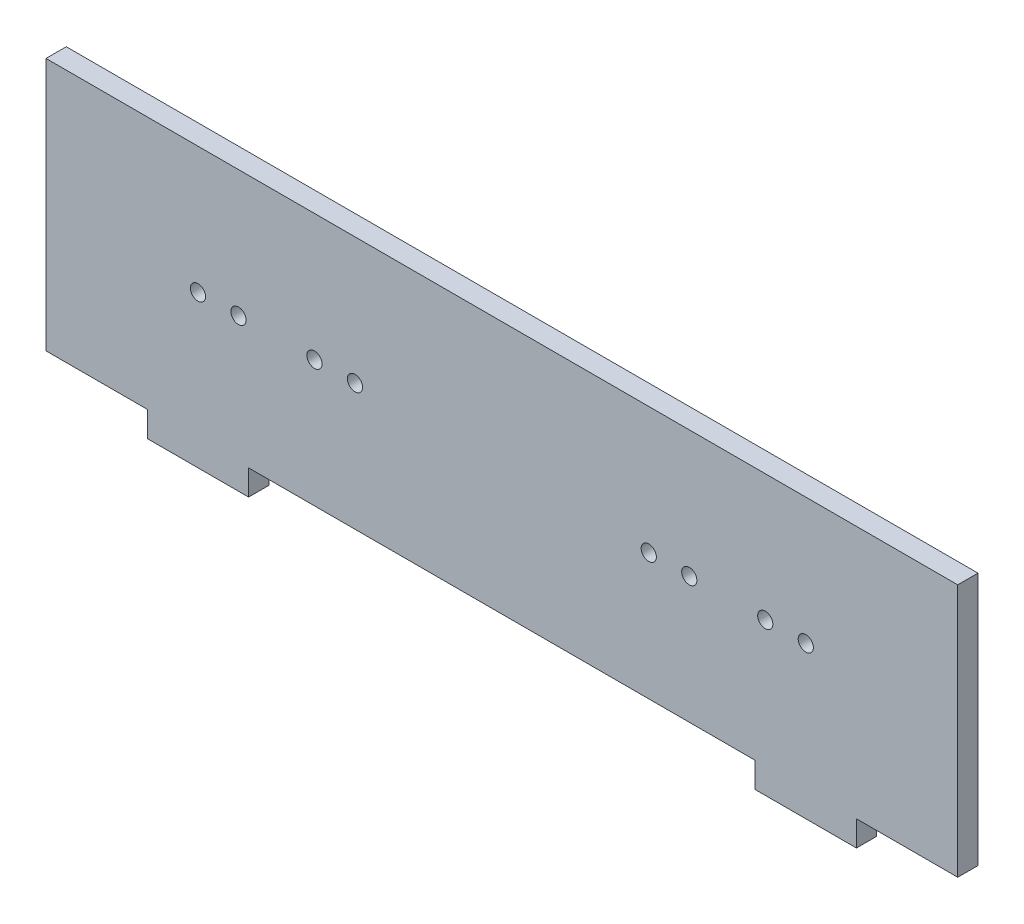
ISO-10303-21;
HEADER;
FILE_DESCRIPTION(('STEP AP214'),'2;1');
FILE_NAME('part.step','',(''),(''),'','','');
FILE_SCHEMA(('AUTOMOTIVE_DESIGN { 1 0 10303 214 1 1 1 1 }'));
ENDSEC;
DATA;
#1=APPLICATION_CONTEXT('core data for automotive mechanical design processes');
#2=APPLICATION_PROTOCOL_DEFINITION('international standard','automotive_design',2000,#1);
#3=PRODUCT_CONTEXT('',#1,'mechanical');
#4=PRODUCT('Part','Part','',(#3));
#5=PRODUCT_RELATED_PRODUCT_CATEGORY('part','',(#4));
#6=PRODUCT_DEFINITION_FORMATION('','',#4);
#7=PRODUCT_DEFINITION_CONTEXT('part definition',#1,'design');
#8=PRODUCT_DEFINITION('design','',#6,#7);
#9=PRODUCT_DEFINITION_SHAPE('','',#8);
#10=(LENGTH_UNIT() NAMED_UNIT(*) SI_UNIT(.MILLI.,.METRE.));
#11=(NAMED_UNIT(*) PLANE_ANGLE_UNIT() SI_UNIT($,.RADIAN.));
#12=(NAMED_UNIT(*) SI_UNIT($,.STERADIAN.) SOLID_ANGLE_UNIT());
#13=UNCERTAINTY_MEASURE_WITH_UNIT(LENGTH_MEASURE(1.E-05),#10,'distance_accuracy_value','');
#14=(GEOMETRIC_REPRESENTATION_CONTEXT(3) GLOBAL_UNCERTAINTY_ASSIGNED_CONTEXT((#13)) GLOBAL_UNIT_ASSIGNED_CONTEXT((#10,
#11,#12)) REPRESENTATION_CONTEXT('',''));
#15=CARTESIAN_POINT('',(0.,0.,0.));
#16=DIRECTION('',(0.,0.,1.));
#17=DIRECTION('',(1.,0.,0.));
#18=AXIS2_PLACEMENT_3D('',#15,#16,#17);
#19=CARTESIAN_POINT('',(0.,0.,4.));
#20=DIRECTION('',(0.,0.,1.));
#21=DIRECTION('',(1.,0.,0.));
#22=AXIS2_PLACEMENT_3D('',#19,#20,#21);
#23=PLANE('',#22);
#24=CARTESIAN_POINT('',(39.7006420545747,-6.11712598425197,4.));
#25=DIRECTION('',(0.,0.,1.));
#26=DIRECTION('',(1.,0.,0.));
#27=AXIS2_PLACEMENT_3D('',#24,#25,#26);
#28=CIRCLE('',#27,1.5);
#29=CARTESIAN_POINT('',(41.2006420545747,-6.11712598425197,4.));
#30=VERTEX_POINT('',#29);
#31=EDGE_CURVE('E306',#30,#30,#28,.T.);
#32=ORIENTED_EDGE('',*,*,#31,.F.);
#33=EDGE_LOOP('',(#32));
#34=FACE_BOUND('',#33,.T.);
#35=CARTESIAN_POINT('',(-34.2993579454253,-6.11712598425197,4.));
#36=DIRECTION('',(0.,0.,1.));
#37=DIRECTION('',(1.,0.,0.));
#38=AXIS2_PLACEMENT_3D('',#35,#36,#37);
#39=CIRCLE('',#38,1.5);
#40=CARTESIAN_POINT('',(-32.7993579454253,-6.11712598425197,4.));
#41=VERTEX_POINT('',#40);
#42=EDGE_CURVE('E318',#41,#41,#39,.T.);
#43=ORIENTED_EDGE('',*,*,#42,.F.);
#44=EDGE_LOOP('',(#43));
#45=FACE_BOUND('',#44,.T.);
#46=CARTESIAN_POINT('',(-49.2993579454253,-6.11712598425197,4.));
#47=DIRECTION('',(0.,0.,1.));
#48=DIRECTION('',(1.,0.,0.));
#49=AXIS2_PLACEMENT_3D('',#46,#47,#48);
#50=CIRCLE('',#49,1.5);
#51=CARTESIAN_POINT('',(-47.7993579454253,-6.11712598425197,4.));
#52=VERTEX_POINT('',#51);
#53=EDGE_CURVE('E330',#52,#52,#50,.T.);
#54=ORIENTED_EDGE('',*,*,#53,.F.);
#55=EDGE_LOOP('',(#54));
#56=FACE_BOUND('',#55,.T.);
#57=CARTESIAN_POINT('',(-57.2993579454253,-6.11712598425197,4.));
#58=DIRECTION('',(0.,0.,1.));
#59=DIRECTION('',(1.,0.,0.));
#60=AXIS2_PLACEMENT_3D('',#57,#58,#59);
#61=CIRCLE('',#60,1.5);
#62=CARTESIAN_POINT('',(-55.7993579454253,-6.11712598425197,4.));
#63=VERTEX_POINT('',#62);
#64=EDGE_CURVE('E157',#63,#63,#61,.T.);
#65=ORIENTED_EDGE('',*,*,#64,.F.);
#66=EDGE_LOOP('',(#65));
#67=FACE_BOUND('',#66,.T.);
#68=DIRECTION('',(0.,-1.,0.));
#69=VECTOR('',#68,1.);
#70=CARTESIAN_POINT('',(-87.2993579454253,18.882874015748,4.));
#71=LINE('',#70,#69);
#72=CARTESIAN_POINT('',(-87.2993579454253,18.882874015748,4.));
#73=VERTEX_POINT('',#72);
#74=CARTESIAN_POINT('',(-87.2993579454253,-31.117125984252,4.));
#75=VERTEX_POINT('',#74);
#76=EDGE_CURVE('E176',#73,#75,#71,.T.);
#77=ORIENTED_EDGE('',*,*,#76,.T.);
#78=DIRECTION('',(1.,0.,0.));
#79=VECTOR('',#78,1.);
#80=CARTESIAN_POINT('',(-87.2993579454253,-31.117125984252,4.));
#81=LINE('',#80,#79);
#82=CARTESIAN_POINT('',(-67.2993579454253,-31.117125984252,4.));
#83=VERTEX_POINT('',#82);
#84=EDGE_CURVE('E104',#75,#83,#81,.T.);
#85=ORIENTED_EDGE('',*,*,#84,.T.);
#86=DIRECTION('',(0.,-1.,0.));
#87=VECTOR('',#86,1.);
#88=CARTESIAN_POINT('',(-67.2993579454253,-31.117125984252,4.));
#89=LINE('',#88,#87);
#90=CARTESIAN_POINT('',(-67.2993579454253,-36.117125984252,4.));
#91=VERTEX_POINT('',#90);
#92=EDGE_CURVE('E203',#83,#91,#89,.T.);
#93=ORIENTED_EDGE('',*,*,#92,.T.);
#94=DIRECTION('',(1.,0.,0.));
#95=VECTOR('',#94,1.);
#96=CARTESIAN_POINT('',(-67.2993579454253,-36.117125984252,4.));
#97=LINE('',#96,#95);
#98=CARTESIAN_POINT('',(-47.2993579454253,-36.117125984252,4.));
#99=VERTEX_POINT('',#98);
#100=EDGE_CURVE('E222',#91,#99,#97,.T.);
#101=ORIENTED_EDGE('',*,*,#100,.T.);
#102=DIRECTION('',(0.,1.,0.));
#103=VECTOR('',#102,1.);
#104=CARTESIAN_POINT('',(-47.2993579454253,-31.117125984252,4.));
#105=LINE('',#104,#103);
#106=CARTESIAN_POINT('',(-47.2993579454253,-31.117125984252,4.));
#107=VERTEX_POINT('',#106);
#108=EDGE_CURVE('E219',#99,#107,#105,.T.);
#109=ORIENTED_EDGE('',*,*,#108,.T.);
#110=DIRECTION('',(1.,0.,0.));
#111=VECTOR('',#110,1.);
#112=CARTESIAN_POINT('',(-47.2993579454253,-31.117125984252,4.));
#113=LINE('',#112,#111);
#114=CARTESIAN_POINT('',(52.7006420545747,-31.117125984252,4.));
#115=VERTEX_POINT('',#114);
#116=EDGE_CURVE('E221',#107,#115,#113,.T.);
#117=ORIENTED_EDGE('',*,*,#116,.T.);
#118=DIRECTION('',(0.,-1.,0.));
#119=VECTOR('',#118,1.);
#120=CARTESIAN_POINT('',(52.7006420545747,-31.117125984252,4.));
#121=LINE('',#120,#119);
#122=CARTESIAN_POINT('',(52.7006420545747,-36.117125984252,4.));
#123=VERTEX_POINT('',#122);
#124=EDGE_CURVE('E224',#115,#123,#121,.T.);
#125=ORIENTED_EDGE('',*,*,#124,.T.);
#126=DIRECTION('',(1.,0.,0.));
#127=VECTOR('',#126,1.);
#128=CARTESIAN_POINT('',(52.7006420545747,-36.117125984252,4.));
#129=LINE('',#128,#127);
#130=CARTESIAN_POINT('',(72.7006420545747,-36.117125984252,4.));
#131=VERTEX_POINT('',#130);
#132=EDGE_CURVE('E230',#123,#131,#129,.T.);
#133=ORIENTED_EDGE('',*,*,#132,.T.);
#134=DIRECTION('',(0.,1.,0.));
#135=VECTOR('',#134,1.);
#136=CARTESIAN_POINT('',(72.7006420545747,-31.117125984252,4.));
#137=LINE('',#136,#135);
#138=CARTESIAN_POINT('',(72.7006420545747,-31.117125984252,4.));
#139=VERTEX_POINT('',#138);
#140=EDGE_CURVE('E135',#131,#139,#137,.T.);
#141=ORIENTED_EDGE('',*,*,#140,.T.);
#142=DIRECTION('',(1.,0.,0.));
#143=VECTOR('',#142,1.);
#144=CARTESIAN_POINT('',(72.7006420545747,-31.117125984252,4.));
#145=LINE('',#144,#143);
#146=CARTESIAN_POINT('',(92.7006420545746,-31.117125984252,4.));
#147=VERTEX_POINT('',#146);
#148=EDGE_CURVE('E129',#139,#147,#145,.T.);
#149=ORIENTED_EDGE('',*,*,#148,.T.);
#150=DIRECTION('',(0.,1.,0.));
#151=VECTOR('',#150,1.);
#152=CARTESIAN_POINT('',(92.7006420545746,18.882874015748,4.));
#153=LINE('',#152,#151);
#154=CARTESIAN_POINT('',(92.7006420545746,18.882874015748,4.));
#155=VERTEX_POINT('',#154);
#156=EDGE_CURVE('E133',#147,#155,#153,.T.);
#157=ORIENTED_EDGE('',*,*,#156,.T.);
#158=DIRECTION('',(-1.,0.,0.));
#159=VECTOR('',#158,1.);
#160=CARTESIAN_POINT('',(-87.2993579454253,18.882874015748,4.));
#161=LINE('',#160,#159);
#162=EDGE_CURVE('E49',#155,#73,#161,.T.);
#163=ORIENTED_EDGE('',*,*,#162,.T.);
#164=EDGE_LOOP('',(#77,#85,#93,#101,#109,#117,#125,#133,#141,#149,#157,#163));
#165=FACE_BOUND('',#164,.T.);
#166=CARTESIAN_POINT('',(62.7006420545747,-6.11712598425197,4.));
#167=DIRECTION('',(0.,0.,1.));
#168=DIRECTION('',(1.,0.,0.));
#169=AXIS2_PLACEMENT_3D('',#166,#167,#168);
#170=CIRCLE('',#169,1.49999999999998);
#171=CARTESIAN_POINT('',(64.2006420545746,-6.11712598425197,4.));
#172=VERTEX_POINT('',#171);
#173=EDGE_CURVE('E336',#172,#172,#170,.T.);
#174=ORIENTED_EDGE('',*,*,#173,.F.);
#175=EDGE_LOOP('',(#174));
#176=FACE_BOUND('',#175,.T.);
#177=CARTESIAN_POINT('',(54.7006420545747,-6.11712598425197,4.));
#178=DIRECTION('',(0.,0.,1.));
#179=DIRECTION('',(1.,0.,0.));
#180=AXIS2_PLACEMENT_3D('',#177,#178,#179);
#181=CIRCLE('',#180,1.5);
#182=CARTESIAN_POINT('',(56.2006420545746,-6.11712598425197,4.));
#183=VERTEX_POINT('',#182);
#184=EDGE_CURVE('E324',#183,#183,#181,.T.);
#185=ORIENTED_EDGE('',*,*,#184,.F.);
#186=EDGE_LOOP('',(#185));
#187=FACE_BOUND('',#186,.T.);
#188=CARTESIAN_POINT('',(-26.2993579454253,-6.11712598425197,4.));
#189=DIRECTION('',(0.,0.,1.));
#190=DIRECTION('',(1.,0.,0.));
#191=AXIS2_PLACEMENT_3D('',#188,#189,#190);
#192=CIRCLE('',#191,1.5);
#193=CARTESIAN_POINT('',(-24.7993579454253,-6.11712598425197,4.));
#194=VERTEX_POINT('',#193);
#195=EDGE_CURVE('E312',#194,#194,#192,.T.);
#196=ORIENTED_EDGE('',*,*,#195,.F.);
#197=EDGE_LOOP('',(#196));
#198=FACE_BOUND('',#197,.T.);
#199=CARTESIAN_POINT('',(31.7006420545747,-6.11712598425197,4.));
#200=DIRECTION('',(0.,0.,1.));
#201=DIRECTION('',(1.,0.,0.));
#202=AXIS2_PLACEMENT_3D('',#199,#200,#201);
#203=CIRCLE('',#202,1.5);
#204=CARTESIAN_POINT('',(33.2006420545747,-6.11712598425197,4.));
#205=VERTEX_POINT('',#204);
#206=EDGE_CURVE('E297',#205,#205,#203,.T.);
#207=ORIENTED_EDGE('',*,*,#206,.F.);
#208=EDGE_LOOP('',(#207));
#209=FACE_BOUND('',#208,.T.);
#210=ADVANCED_FACE('F32',(#34,#45,#56,#67,#165,#176,#187,#198,#209),#23,.T.);
#211=CARTESIAN_POINT('',(0.,0.,0.));
#212=DIRECTION('',(0.,0.,1.));
#213=DIRECTION('',(1.,0.,0.));
#214=AXIS2_PLACEMENT_3D('',#211,#212,#213);
#215=PLANE('',#214);
#216=DIRECTION('',(0.,-1.,0.));
#217=VECTOR('',#216,1.);
#218=CARTESIAN_POINT('',(-87.2993579454253,18.882874015748,0.));
#219=LINE('',#218,#217);
#220=CARTESIAN_POINT('',(-87.2993579454253,18.882874015748,0.));
#221=VERTEX_POINT('',#220);
#222=CARTESIAN_POINT('',(-87.2993579454253,-31.117125984252,0.));
#223=VERTEX_POINT('',#222);
#224=EDGE_CURVE('E153',#221,#223,#219,.T.);
#225=ORIENTED_EDGE('',*,*,#224,.F.);
#226=DIRECTION('',(-1.,0.,0.));
#227=VECTOR('',#226,1.);
#228=CARTESIAN_POINT('',(-87.2993579454253,18.882874015748,0.));
#229=LINE('',#228,#227);
#230=CARTESIAN_POINT('',(92.7006420545746,18.882874015748,0.));
#231=VERTEX_POINT('',#230);
#232=EDGE_CURVE('E96',#231,#221,#229,.T.);
#233=ORIENTED_EDGE('',*,*,#232,.F.);
#234=DIRECTION('',(0.,1.,0.));
#235=VECTOR('',#234,1.);
#236=CARTESIAN_POINT('',(92.7006420545746,18.882874015748,0.));
#237=LINE('',#236,#235);
#238=CARTESIAN_POINT('',(92.7006420545746,-31.117125984252,0.));
#239=VERTEX_POINT('',#238);
#240=EDGE_CURVE('E90',#239,#231,#237,.T.);
#241=ORIENTED_EDGE('',*,*,#240,.F.);
#242=DIRECTION('',(1.,0.,0.));
#243=VECTOR('',#242,1.);
#244=CARTESIAN_POINT('',(72.7006420545747,-31.117125984252,0.));
#245=LINE('',#244,#243);
#246=CARTESIAN_POINT('',(72.7006420545747,-31.117125984252,0.));
#247=VERTEX_POINT('',#246);
#248=EDGE_CURVE('E143',#247,#239,#245,.T.);
#249=ORIENTED_EDGE('',*,*,#248,.F.);
#250=DIRECTION('',(0.,1.,0.));
#251=VECTOR('',#250,1.);
#252=CARTESIAN_POINT('',(72.7006420545747,-31.117125984252,0.));
#253=LINE('',#252,#251);
#254=CARTESIAN_POINT('',(72.7006420545747,-36.117125984252,0.));
#255=VERTEX_POINT('',#254);
#256=EDGE_CURVE('E171',#255,#247,#253,.T.);
#257=ORIENTED_EDGE('',*,*,#256,.F.);
#258=DIRECTION('',(1.,0.,0.));
#259=VECTOR('',#258,1.);
#260=CARTESIAN_POINT('',(52.7006420545747,-36.117125984252,0.));
#261=LINE('',#260,#259);
#262=CARTESIAN_POINT('',(52.7006420545747,-36.117125984252,0.));
#263=VERTEX_POINT('',#262);
#264=EDGE_CURVE('E169',#263,#255,#261,.T.);
#265=ORIENTED_EDGE('',*,*,#264,.F.);
#266=DIRECTION('',(0.,-1.,0.));
#267=VECTOR('',#266,1.);
#268=CARTESIAN_POINT('',(52.7006420545747,-31.117125984252,0.));
#269=LINE('',#268,#267);
#270=CARTESIAN_POINT('',(52.7006420545747,-31.117125984252,0.));
#271=VERTEX_POINT('',#270);
#272=EDGE_CURVE('E167',#271,#263,#269,.T.);
#273=ORIENTED_EDGE('',*,*,#272,.F.);
#274=DIRECTION('',(1.,0.,0.));
#275=VECTOR('',#274,1.);
#276=CARTESIAN_POINT('',(-47.2993579454253,-31.117125984252,0.));
#277=LINE('',#276,#275);
#278=CARTESIAN_POINT('',(-47.2993579454253,-31.117125984252,0.));
#279=VERTEX_POINT('',#278);
#280=EDGE_CURVE('E165',#279,#271,#277,.T.);
#281=ORIENTED_EDGE('',*,*,#280,.F.);
#282=DIRECTION('',(0.,1.,0.));
#283=VECTOR('',#282,1.);
#284=CARTESIAN_POINT('',(-47.2993579454253,-31.117125984252,0.));
#285=LINE('',#284,#283);
#286=CARTESIAN_POINT('',(-47.2993579454253,-36.117125984252,0.));
#287=VERTEX_POINT('',#286);
#288=EDGE_CURVE('E163',#287,#279,#285,.T.);
#289=ORIENTED_EDGE('',*,*,#288,.F.);
#290=DIRECTION('',(1.,0.,0.));
#291=VECTOR('',#290,1.);
#292=CARTESIAN_POINT('',(-67.2993579454253,-36.117125984252,0.));
#293=LINE('',#292,#291);
#294=CARTESIAN_POINT('',(-67.2993579454253,-36.117125984252,0.));
#295=VERTEX_POINT('',#294);
#296=EDGE_CURVE('E161',#295,#287,#293,.T.);
#297=ORIENTED_EDGE('',*,*,#296,.F.);
#298=DIRECTION('',(0.,-1.,0.));
#299=VECTOR('',#298,1.);
#300=CARTESIAN_POINT('',(-67.2993579454253,-31.117125984252,0.));
#301=LINE('',#300,#299);
#302=CARTESIAN_POINT('',(-67.2993579454253,-31.117125984252,0.));
#303=VERTEX_POINT('',#302);
#304=EDGE_CURVE('E159',#303,#295,#301,.T.);
#305=ORIENTED_EDGE('',*,*,#304,.F.);
#306=DIRECTION('',(1.,0.,0.));
#307=VECTOR('',#306,1.);
#308=CARTESIAN_POINT('',(-87.2993579454253,-31.117125984252,0.));
#309=LINE('',#308,#307);
#310=EDGE_CURVE('E156',#223,#303,#309,.T.);
#311=ORIENTED_EDGE('',*,*,#310,.F.);
#312=EDGE_LOOP('',(#225,#233,#241,#249,#257,#265,#273,#281,#289,#297,#305,#311));
#313=FACE_BOUND('',#312,.T.);
#314=CARTESIAN_POINT('',(-57.2993579454253,-6.11712598425197,0.));
#315=DIRECTION('',(0.,0.,1.));
#316=DIRECTION('',(1.,0.,0.));
#317=AXIS2_PLACEMENT_3D('',#314,#315,#316);
#318=CIRCLE('',#317,1.5);
#319=CARTESIAN_POINT('',(-55.7993579454253,-6.11712598425197,0.));
#320=VERTEX_POINT('',#319);
#321=EDGE_CURVE('E339',#320,#320,#318,.T.);
#322=ORIENTED_EDGE('',*,*,#321,.T.);
#323=EDGE_LOOP('',(#322));
#324=FACE_BOUND('',#323,.T.);
#325=CARTESIAN_POINT('',(62.7006420545747,-6.11712598425197,0.));
#326=DIRECTION('',(0.,0.,1.));
#327=DIRECTION('',(1.,0.,0.));
#328=AXIS2_PLACEMENT_3D('',#325,#326,#327);
#329=CIRCLE('',#328,1.49999999999998);
#330=CARTESIAN_POINT('',(64.2006420545746,-6.11712598425197,0.));
#331=VERTEX_POINT('',#330);
#332=EDGE_CURVE('E333',#331,#331,#329,.T.);
#333=ORIENTED_EDGE('',*,*,#332,.T.);
#334=EDGE_LOOP('',(#333));
#335=FACE_BOUND('',#334,.T.);
#336=CARTESIAN_POINT('',(-49.2993579454253,-6.11712598425197,0.));
#337=DIRECTION('',(0.,0.,1.));
#338=DIRECTION('',(1.,0.,0.));
#339=AXIS2_PLACEMENT_3D('',#336,#337,#338);
#340=CIRCLE('',#339,1.5);
#341=CARTESIAN_POINT('',(-47.7993579454253,-6.11712598425197,0.));
#342=VERTEX_POINT('',#341);
#343=EDGE_CURVE('E327',#342,#342,#340,.T.);
#344=ORIENTED_EDGE('',*,*,#343,.T.);
#345=EDGE_LOOP('',(#344));
#346=FACE_BOUND('',#345,.T.);
#347=CARTESIAN_POINT('',(54.7006420545747,-6.11712598425197,0.));
#348=DIRECTION('',(0.,0.,1.));
#349=DIRECTION('',(1.,0.,0.));
#350=AXIS2_PLACEMENT_3D('',#347,#348,#349);
#351=CIRCLE('',#350,1.5);
#352=CARTESIAN_POINT('',(56.2006420545746,-6.11712598425197,0.));
#353=VERTEX_POINT('',#352);
#354=EDGE_CURVE('E321',#353,#353,#351,.T.);
#355=ORIENTED_EDGE('',*,*,#354,.T.);
#356=EDGE_LOOP('',(#355));
#357=FACE_BOUND('',#356,.T.);
#358=CARTESIAN_POINT('',(-34.2993579454253,-6.11712598425197,0.));
#359=DIRECTION('',(0.,0.,1.));
#360=DIRECTION('',(1.,0.,0.));
#361=AXIS2_PLACEMENT_3D('',#358,#359,#360);
#362=CIRCLE('',#361,1.5);
#363=CARTESIAN_POINT('',(-32.7993579454253,-6.11712598425197,0.));
#364=VERTEX_POINT('',#363);
#365=EDGE_CURVE('E315',#364,#364,#362,.T.);
#366=ORIENTED_EDGE('',*,*,#365,.T.);
#367=EDGE_LOOP('',(#366));
#368=FACE_BOUND('',#367,.T.);
#369=CARTESIAN_POINT('',(-26.2993579454253,-6.11712598425197,0.));
#370=DIRECTION('',(0.,0.,1.));
#371=DIRECTION('',(1.,0.,0.));
#372=AXIS2_PLACEMENT_3D('',#369,#370,#371);
#373=CIRCLE('',#372,1.5);
#374=CARTESIAN_POINT('',(-24.7993579454253,-6.11712598425197,0.));
#375=VERTEX_POINT('',#374);
#376=EDGE_CURVE('E309',#375,#375,#373,.T.);
#377=ORIENTED_EDGE('',*,*,#376,.T.);
#378=EDGE_LOOP('',(#377));
#379=FACE_BOUND('',#378,.T.);
#380=CARTESIAN_POINT('',(39.7006420545747,-6.11712598425197,0.));
#381=DIRECTION('',(0.,0.,1.));
#382=DIRECTION('',(1.,0.,0.));
#383=AXIS2_PLACEMENT_3D('',#380,#381,#382);
#384=CIRCLE('',#383,1.5);
#385=CARTESIAN_POINT('',(41.2006420545747,-6.11712598425197,0.));
#386=VERTEX_POINT('',#385);
#387=EDGE_CURVE('E303',#386,#386,#384,.T.);
#388=ORIENTED_EDGE('',*,*,#387,.T.);
#389=EDGE_LOOP('',(#388));
#390=FACE_BOUND('',#389,.T.);
#391=CARTESIAN_POINT('',(31.7006420545747,-6.11712598425197,0.));
#392=DIRECTION('',(0.,0.,1.));
#393=DIRECTION('',(1.,0.,0.));
#394=AXIS2_PLACEMENT_3D('',#391,#392,#393);
#395=CIRCLE('',#394,1.5);
#396=CARTESIAN_POINT('',(33.2006420545747,-6.11712598425197,0.));
#397=VERTEX_POINT('',#396);
#398=EDGE_CURVE('E300',#397,#397,#395,.T.);
#399=ORIENTED_EDGE('',*,*,#398,.T.);
#400=EDGE_LOOP('',(#399));
#401=FACE_BOUND('',#400,.T.);
#402=ADVANCED_FACE('F207',(#313,#324,#335,#346,#357,#368,#379,#390,#401),#215,.F.);
#403=CARTESIAN_POINT('',(-87.2993579454253,18.882874015748,4.));
#404=DIRECTION('',(1.,0.,0.));
#405=DIRECTION('',(0.,1.,0.));
#406=AXIS2_PLACEMENT_3D('',#403,#404,#405);
#407=PLANE('',#406);
#408=ORIENTED_EDGE('',*,*,#224,.T.);
#409=DIRECTION('',(0.,0.,-1.));
#410=VECTOR('',#409,1.);
#411=CARTESIAN_POINT('',(-87.2993579454253,-31.117125984252,4.));
#412=LINE('',#411,#410);
#413=EDGE_CURVE('E11',#75,#223,#412,.T.);
#414=ORIENTED_EDGE('',*,*,#413,.F.);
#415=ORIENTED_EDGE('',*,*,#76,.F.);
#416=DIRECTION('',(0.,0.,-1.));
#417=VECTOR('',#416,1.);
#418=CARTESIAN_POINT('',(-87.2993579454253,18.882874015748,4.));
#419=LINE('',#418,#417);
#420=EDGE_CURVE('E149',#73,#221,#419,.T.);
#421=ORIENTED_EDGE('',*,*,#420,.T.);
#422=EDGE_LOOP('',(#408,#414,#415,#421));
#423=FACE_BOUND('',#422,.T.);
#424=ADVANCED_FACE('F34',(#423),#407,.F.);
#425=CARTESIAN_POINT('',(-87.2993579454253,-31.117125984252,4.));
#426=DIRECTION('',(0.,1.,0.));
#427=DIRECTION('',(0.,0.,1.));
#428=AXIS2_PLACEMENT_3D('',#425,#426,#427);
#429=PLANE('',#428);
#430=ORIENTED_EDGE('',*,*,#310,.T.);
#431=DIRECTION('',(0.,0.,-1.));
#432=VECTOR('',#431,1.);
#433=CARTESIAN_POINT('',(-67.2993579454253,-31.117125984252,4.));
#434=LINE('',#433,#432);
#435=EDGE_CURVE('E41',#83,#303,#434,.T.);
#436=ORIENTED_EDGE('',*,*,#435,.F.);
#437=ORIENTED_EDGE('',*,*,#84,.F.);
#438=ORIENTED_EDGE('',*,*,#413,.T.);
#439=EDGE_LOOP('',(#430,#436,#437,#438));
#440=FACE_BOUND('',#439,.T.);
#441=ADVANCED_FACE('F485',(#440),#429,.F.);
#442=CARTESIAN_POINT('',(-67.2993579454253,-31.117125984252,4.));
#443=DIRECTION('',(1.,0.,0.));
#444=DIRECTION('',(0.,0.,-1.));
#445=AXIS2_PLACEMENT_3D('',#442,#443,#444);
#446=PLANE('',#445);
#447=ORIENTED_EDGE('',*,*,#304,.T.);
#448=DIRECTION('',(0.,0.,-1.));
#449=VECTOR('',#448,1.);
#450=CARTESIAN_POINT('',(-67.2993579454253,-36.117125984252,4.));
#451=LINE('',#450,#449);
#452=EDGE_CURVE('E195',#91,#295,#451,.T.);
#453=ORIENTED_EDGE('',*,*,#452,.F.);
#454=ORIENTED_EDGE('',*,*,#92,.F.);
#455=ORIENTED_EDGE('',*,*,#435,.T.);
#456=EDGE_LOOP('',(#447,#453,#454,#455));
#457=FACE_BOUND('',#456,.T.);
#458=ADVANCED_FACE('F201',(#457),#446,.F.);
#459=CARTESIAN_POINT('',(-67.2993579454253,-36.117125984252,4.));
#460=DIRECTION('',(0.,1.,0.));
#461=DIRECTION('',(0.,0.,1.));
#462=AXIS2_PLACEMENT_3D('',#459,#460,#461);
#463=PLANE('',#462);
#464=ORIENTED_EDGE('',*,*,#296,.T.);
#465=DIRECTION('',(0.,0.,-1.));
#466=VECTOR('',#465,1.);
#467=CARTESIAN_POINT('',(-47.2993579454253,-36.117125984252,4.));
#468=LINE('',#467,#466);
#469=EDGE_CURVE('E192',#99,#287,#468,.T.);
#470=ORIENTED_EDGE('',*,*,#469,.F.);
#471=ORIENTED_EDGE('',*,*,#100,.F.);
#472=ORIENTED_EDGE('',*,*,#452,.T.);
#473=EDGE_LOOP('',(#464,#470,#471,#472));
#474=FACE_BOUND('',#473,.T.);
#475=ADVANCED_FACE('F213',(#474),#463,.F.);
#476=CARTESIAN_POINT('',(-47.2993579454253,-31.117125984252,4.));
#477=DIRECTION('',(-1.,0.,0.));
#478=DIRECTION('',(0.,-1.,0.));
#479=AXIS2_PLACEMENT_3D('',#476,#477,#478);
#480=PLANE('',#479);
#481=ORIENTED_EDGE('',*,*,#288,.T.);
#482=DIRECTION('',(0.,0.,-1.));
#483=VECTOR('',#482,1.);
#484=CARTESIAN_POINT('',(-47.2993579454253,-31.117125984252,4.));
#485=LINE('',#484,#483);
#486=EDGE_CURVE('E189',#107,#279,#485,.T.);
#487=ORIENTED_EDGE('',*,*,#486,.F.);
#488=ORIENTED_EDGE('',*,*,#108,.F.);
#489=ORIENTED_EDGE('',*,*,#469,.T.);
#490=EDGE_LOOP('',(#481,#487,#488,#489));
#491=FACE_BOUND('',#490,.T.);
#492=ADVANCED_FACE('F217',(#491),#480,.F.);
#493=CARTESIAN_POINT('',(-47.2993579454253,-31.117125984252,4.));
#494=DIRECTION('',(0.,1.,0.));
#495=DIRECTION('',(0.,0.,1.));
#496=AXIS2_PLACEMENT_3D('',#493,#494,#495);
#497=PLANE('',#496);
#498=ORIENTED_EDGE('',*,*,#280,.T.);
#499=DIRECTION('',(0.,0.,-1.));
#500=VECTOR('',#499,1.);
#501=CARTESIAN_POINT('',(52.7006420545747,-31.117125984252,4.));
#502=LINE('',#501,#500);
#503=EDGE_CURVE('E186',#115,#271,#502,.T.);
#504=ORIENTED_EDGE('',*,*,#503,.F.);
#505=ORIENTED_EDGE('',*,*,#116,.F.);
#506=ORIENTED_EDGE('',*,*,#486,.T.);
#507=EDGE_LOOP('',(#498,#504,#505,#506));
#508=FACE_BOUND('',#507,.T.);
#509=ADVANCED_FACE('F450',(#508),#497,.F.);
#510=CARTESIAN_POINT('',(52.7006420545747,-31.117125984252,4.));
#511=DIRECTION('',(1.,0.,0.));
#512=DIRECTION('',(0.,0.,-1.));
#513=AXIS2_PLACEMENT_3D('',#510,#511,#512);
#514=PLANE('',#513);
#515=ORIENTED_EDGE('',*,*,#272,.T.);
#516=DIRECTION('',(0.,0.,-1.));
#517=VECTOR('',#516,1.);
#518=CARTESIAN_POINT('',(52.7006420545747,-36.117125984252,4.));
#519=LINE('',#518,#517);
#520=EDGE_CURVE('E183',#123,#263,#519,.T.);
#521=ORIENTED_EDGE('',*,*,#520,.F.);
#522=ORIENTED_EDGE('',*,*,#124,.F.);
#523=ORIENTED_EDGE('',*,*,#503,.T.);
#524=EDGE_LOOP('',(#515,#521,#522,#523));
#525=FACE_BOUND('',#524,.T.);
#526=ADVANCED_FACE('F441',(#525),#514,.F.);
#527=CARTESIAN_POINT('',(52.7006420545747,-36.117125984252,4.));
#528=DIRECTION('',(0.,1.,0.));
#529=DIRECTION('',(0.,0.,1.));
#530=AXIS2_PLACEMENT_3D('',#527,#528,#529);
#531=PLANE('',#530);
#532=ORIENTED_EDGE('',*,*,#264,.T.);
#533=DIRECTION('',(0.,0.,-1.));
#534=VECTOR('',#533,1.);
#535=CARTESIAN_POINT('',(72.7006420545747,-36.117125984252,4.));
#536=LINE('',#535,#534);
#537=EDGE_CURVE('E180',#131,#255,#536,.T.);
#538=ORIENTED_EDGE('',*,*,#537,.F.);
#539=ORIENTED_EDGE('',*,*,#132,.F.);
#540=ORIENTED_EDGE('',*,*,#520,.T.);
#541=EDGE_LOOP('',(#532,#538,#539,#540));
#542=FACE_BOUND('',#541,.T.);
#543=ADVANCED_FACE('F236',(#542),#531,.F.);
#544=CARTESIAN_POINT('',(72.7006420545747,-31.117125984252,4.));
#545=DIRECTION('',(-1.,0.,0.));
#546=DIRECTION('',(0.,-1.,0.));
#547=AXIS2_PLACEMENT_3D('',#544,#545,#546);
#548=PLANE('',#547);
#549=ORIENTED_EDGE('',*,*,#256,.T.);
#550=DIRECTION('',(0.,0.,-1.));
#551=VECTOR('',#550,1.);
#552=CARTESIAN_POINT('',(72.7006420545747,-31.117125984252,4.));
#553=LINE('',#552,#551);
#554=EDGE_CURVE('E144',#139,#247,#553,.T.);
#555=ORIENTED_EDGE('',*,*,#554,.F.);
#556=ORIENTED_EDGE('',*,*,#140,.F.);
#557=ORIENTED_EDGE('',*,*,#537,.T.);
#558=EDGE_LOOP('',(#549,#555,#556,#557));
#559=FACE_BOUND('',#558,.T.);
#560=ADVANCED_FACE('F240',(#559),#548,.F.);
#561=CARTESIAN_POINT('',(72.7006420545747,-31.117125984252,4.));
#562=DIRECTION('',(0.,1.,0.));
#563=DIRECTION('',(0.,0.,1.));
#564=AXIS2_PLACEMENT_3D('',#561,#562,#563);
#565=PLANE('',#564);
#566=ORIENTED_EDGE('',*,*,#248,.T.);
#567=DIRECTION('',(0.,0.,-1.));
#568=VECTOR('',#567,1.);
#569=CARTESIAN_POINT('',(92.7006420545746,-31.117125984252,4.));
#570=LINE('',#569,#568);
#571=EDGE_CURVE('E140',#147,#239,#570,.T.);
#572=ORIENTED_EDGE('',*,*,#571,.F.);
#573=ORIENTED_EDGE('',*,*,#148,.F.);
#574=ORIENTED_EDGE('',*,*,#554,.T.);
#575=EDGE_LOOP('',(#566,#572,#573,#574));
#576=FACE_BOUND('',#575,.T.);
#577=ADVANCED_FACE('F141',(#576),#565,.F.);
#578=CARTESIAN_POINT('',(92.7006420545746,18.882874015748,4.));
#579=DIRECTION('',(-1.,0.,0.));
#580=DIRECTION('',(0.,0.,1.));
#581=AXIS2_PLACEMENT_3D('',#578,#579,#580);
#582=PLANE('',#581);
#583=ORIENTED_EDGE('',*,*,#240,.T.);
#584=DIRECTION('',(0.,0.,-1.));
#585=VECTOR('',#584,1.);
#586=CARTESIAN_POINT('',(92.7006420545746,18.882874015748,4.));
#587=LINE('',#586,#585);
#588=EDGE_CURVE('E145',#155,#231,#587,.T.);
#589=ORIENTED_EDGE('',*,*,#588,.F.);
#590=ORIENTED_EDGE('',*,*,#156,.F.);
#591=ORIENTED_EDGE('',*,*,#571,.T.);
#592=EDGE_LOOP('',(#583,#589,#590,#591));
#593=FACE_BOUND('',#592,.T.);
#594=ADVANCED_FACE('F147',(#593),#582,.F.);
#595=CARTESIAN_POINT('',(-87.2993579454253,18.882874015748,4.));
#596=DIRECTION('',(0.,-1.,0.));
#597=DIRECTION('',(0.,0.,-1.));
#598=AXIS2_PLACEMENT_3D('',#595,#596,#597);
#599=PLANE('',#598);
#600=ORIENTED_EDGE('',*,*,#232,.T.);
#601=ORIENTED_EDGE('',*,*,#420,.F.);
#602=ORIENTED_EDGE('',*,*,#162,.F.);
#603=ORIENTED_EDGE('',*,*,#588,.T.);
#604=EDGE_LOOP('',(#600,#601,#602,#603));
#605=FACE_BOUND('',#604,.T.);
#606=ADVANCED_FACE('F244',(#605),#599,.F.);
#607=CARTESIAN_POINT('',(-57.2993579454253,-6.11712598425197,4.));
#608=DIRECTION('',(0.,0.,-1.));
#609=DIRECTION('',(-1.,0.,0.));
#610=AXIS2_PLACEMENT_3D('',#607,#608,#609);
#611=CYLINDRICAL_SURFACE('',#610,1.5);
#612=ORIENTED_EDGE('',*,*,#64,.T.);
#613=EDGE_LOOP('',(#612));
#614=FACE_BOUND('',#613,.T.);
#615=ORIENTED_EDGE('',*,*,#321,.F.);
#616=EDGE_LOOP('',(#615));
#617=FACE_BOUND('',#616,.T.);
#618=ADVANCED_FACE('F246',(#614,#617),#611,.F.);
#619=CARTESIAN_POINT('',(62.7006420545747,-6.11712598425197,4.));
#620=DIRECTION('',(0.,0.,-1.));
#621=DIRECTION('',(-1.,0.,0.));
#622=AXIS2_PLACEMENT_3D('',#619,#620,#621);
#623=CYLINDRICAL_SURFACE('',#622,1.49999999999998);
#624=ORIENTED_EDGE('',*,*,#173,.T.);
#625=EDGE_LOOP('',(#624));
#626=FACE_BOUND('',#625,.T.);
#627=ORIENTED_EDGE('',*,*,#332,.F.);
#628=EDGE_LOOP('',(#627));
#629=FACE_BOUND('',#628,.T.);
#630=ADVANCED_FACE('F252',(#626,#629),#623,.F.);
#631=CARTESIAN_POINT('',(-49.2993579454253,-6.11712598425197,4.));
#632=DIRECTION('',(0.,0.,-1.));
#633=DIRECTION('',(-1.,0.,0.));
#634=AXIS2_PLACEMENT_3D('',#631,#632,#633);
#635=CYLINDRICAL_SURFACE('',#634,1.5);
#636=ORIENTED_EDGE('',*,*,#53,.T.);
#637=EDGE_LOOP('',(#636));
#638=FACE_BOUND('',#637,.T.);
#639=ORIENTED_EDGE('',*,*,#343,.F.);
#640=EDGE_LOOP('',(#639));
#641=FACE_BOUND('',#640,.T.);
#642=ADVANCED_FACE('F268',(#638,#641),#635,.F.);
#643=CARTESIAN_POINT('',(54.7006420545747,-6.11712598425197,4.));
#644=DIRECTION('',(0.,0.,-1.));
#645=DIRECTION('',(-1.,0.,0.));
#646=AXIS2_PLACEMENT_3D('',#643,#644,#645);
#647=CYLINDRICAL_SURFACE('',#646,1.5);
#648=ORIENTED_EDGE('',*,*,#184,.T.);
#649=EDGE_LOOP('',(#648));
#650=FACE_BOUND('',#649,.T.);
#651=ORIENTED_EDGE('',*,*,#354,.F.);
#652=EDGE_LOOP('',(#651));
#653=FACE_BOUND('',#652,.T.);
#654=ADVANCED_FACE('F272',(#650,#653),#647,.F.);
#655=CARTESIAN_POINT('',(-34.2993579454253,-6.11712598425197,4.));
#656=DIRECTION('',(0.,0.,-1.));
#657=DIRECTION('',(-1.,0.,0.));
#658=AXIS2_PLACEMENT_3D('',#655,#656,#657);
#659=CYLINDRICAL_SURFACE('',#658,1.5);
#660=ORIENTED_EDGE('',*,*,#42,.T.);
#661=EDGE_LOOP('',(#660));
#662=FACE_BOUND('',#661,.T.);
#663=ORIENTED_EDGE('',*,*,#365,.F.);
#664=EDGE_LOOP('',(#663));
#665=FACE_BOUND('',#664,.T.);
#666=ADVANCED_FACE('F276',(#662,#665),#659,.F.);
#667=CARTESIAN_POINT('',(-26.2993579454253,-6.11712598425197,4.));
#668=DIRECTION('',(0.,0.,-1.));
#669=DIRECTION('',(-1.,0.,0.));
#670=AXIS2_PLACEMENT_3D('',#667,#668,#669);
#671=CYLINDRICAL_SURFACE('',#670,1.5);
#672=ORIENTED_EDGE('',*,*,#195,.T.);
#673=EDGE_LOOP('',(#672));
#674=FACE_BOUND('',#673,.T.);
#675=ORIENTED_EDGE('',*,*,#376,.F.);
#676=EDGE_LOOP('',(#675));
#677=FACE_BOUND('',#676,.T.);
#678=ADVANCED_FACE('F280',(#674,#677),#671,.F.);
#679=CARTESIAN_POINT('',(39.7006420545747,-6.11712598425197,4.));
#680=DIRECTION('',(0.,0.,-1.));
#681=DIRECTION('',(-1.,0.,0.));
#682=AXIS2_PLACEMENT_3D('',#679,#680,#681);
#683=CYLINDRICAL_SURFACE('',#682,1.5);
#684=ORIENTED_EDGE('',*,*,#31,.T.);
#685=EDGE_LOOP('',(#684));
#686=FACE_BOUND('',#685,.T.);
#687=ORIENTED_EDGE('',*,*,#387,.F.);
#688=EDGE_LOOP('',(#687));
#689=FACE_BOUND('',#688,.T.);
#690=ADVANCED_FACE('F284',(#686,#689),#683,.F.);
#691=CARTESIAN_POINT('',(31.7006420545747,-6.11712598425197,4.));
#692=DIRECTION('',(0.,0.,-1.));
#693=DIRECTION('',(-1.,0.,0.));
#694=AXIS2_PLACEMENT_3D('',#691,#692,#693);
#695=CYLINDRICAL_SURFACE('',#694,1.5);
#696=ORIENTED_EDGE('',*,*,#206,.T.);
#697=EDGE_LOOP('',(#696));
#698=FACE_BOUND('',#697,.T.);
#699=ORIENTED_EDGE('',*,*,#398,.F.);
#700=EDGE_LOOP('',(#699));
#701=FACE_BOUND('',#700,.T.);
#702=ADVANCED_FACE('F288',(#698,#701),#695,.F.);
#703=CLOSED_SHELL('',(#210,#402,#424,#441,#458,#475,#492,#509,#526,#543,#560,#577,#594,#606,
#618,#630,#642,#654,#666,#678,#690,#702));
#704=MANIFOLD_SOLID_BREP('B2',#703);
#705=ADVANCED_BREP_SHAPE_REPRESENTATION('',(#18,#704),#14);
#706=SHAPE_DEFINITION_REPRESENTATION(#9,#705);
ENDSEC;
END-ISO-10303-21;
